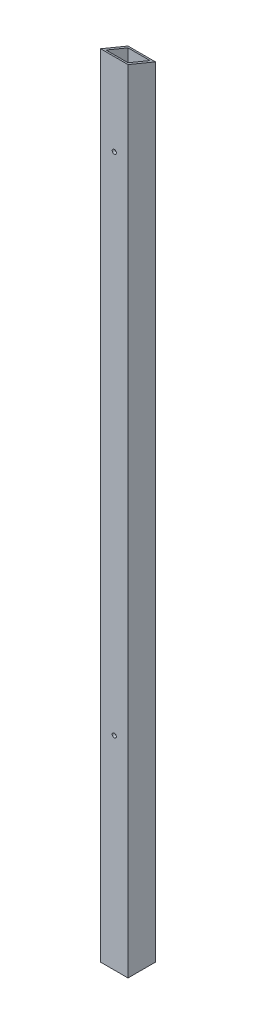
ISO-10303-21;
HEADER;
FILE_DESCRIPTION(('STEP AP214'),'2;1');
FILE_NAME('part.step','',(''),(''),'','','');
FILE_SCHEMA(('AUTOMOTIVE_DESIGN { 1 0 10303 214 1 1 1 1 }'));
ENDSEC;
DATA;
#1=APPLICATION_CONTEXT('core data for automotive mechanical design processes');
#2=APPLICATION_PROTOCOL_DEFINITION('international standard','automotive_design',2000,#1);
#3=PRODUCT_CONTEXT('',#1,'mechanical');
#4=PRODUCT('Part','Part','',(#3));
#5=PRODUCT_RELATED_PRODUCT_CATEGORY('part','',(#4));
#6=PRODUCT_DEFINITION_FORMATION('','',#4);
#7=PRODUCT_DEFINITION_CONTEXT('part definition',#1,'design');
#8=PRODUCT_DEFINITION('design','',#6,#7);
#9=PRODUCT_DEFINITION_SHAPE('','',#8);
#10=(LENGTH_UNIT() NAMED_UNIT(*) SI_UNIT(.MILLI.,.METRE.));
#11=(NAMED_UNIT(*) PLANE_ANGLE_UNIT() SI_UNIT($,.RADIAN.));
#12=(NAMED_UNIT(*) SI_UNIT($,.STERADIAN.) SOLID_ANGLE_UNIT());
#13=UNCERTAINTY_MEASURE_WITH_UNIT(LENGTH_MEASURE(1.E-05),#10,'distance_accuracy_value','');
#14=(GEOMETRIC_REPRESENTATION_CONTEXT(3) GLOBAL_UNCERTAINTY_ASSIGNED_CONTEXT((#13)) GLOBAL_UNIT_ASSIGNED_CONTEXT((#10,
#11,#12)) REPRESENTATION_CONTEXT('',''));
#15=CARTESIAN_POINT('',(0.,0.,0.));
#16=DIRECTION('',(0.,0.,1.));
#17=DIRECTION('',(1.,0.,0.));
#18=AXIS2_PLACEMENT_3D('',#15,#16,#17);
#19=CARTESIAN_POINT('',(15.875,819.15,0.));
#20=DIRECTION('',(0.,0.,1.));
#21=DIRECTION('',(1.,0.,0.));
#22=AXIS2_PLACEMENT_3D('',#19,#20,#21);
#23=CYLINDRICAL_SURFACE('',#22,2.413);
#24=CARTESIAN_POINT('',(15.875,819.15,-28.575));
#25=DIRECTION('',(0.,0.,1.));
#26=DIRECTION('',(1.,0.,0.));
#27=AXIS2_PLACEMENT_3D('',#24,#25,#26);
#28=CIRCLE('',#27,2.413);
#29=CARTESIAN_POINT('',(18.288,819.15,-28.575));
#30=VERTEX_POINT('',#29);
#31=EDGE_CURVE('E124',#30,#30,#28,.F.);
#32=ORIENTED_EDGE('',*,*,#31,.F.);
#33=EDGE_LOOP('',(#32));
#34=FACE_BOUND('',#33,.T.);
#35=CARTESIAN_POINT('',(15.875,819.15,-31.75));
#36=DIRECTION('',(0.,0.,1.));
#37=DIRECTION('',(1.,0.,0.));
#38=AXIS2_PLACEMENT_3D('',#35,#36,#37);
#39=CIRCLE('',#38,2.413);
#40=CARTESIAN_POINT('',(18.288,819.15,-31.75));
#41=VERTEX_POINT('',#40);
#42=EDGE_CURVE('E20',#41,#41,#39,.T.);
#43=ORIENTED_EDGE('',*,*,#42,.F.);
#44=EDGE_LOOP('',(#43));
#45=FACE_BOUND('',#44,.T.);
#46=ADVANCED_FACE('F17',(#34,#45),#23,.F.);
#47=CARTESIAN_POINT('',(15.875,234.8484,0.));
#48=DIRECTION('',(0.,0.,1.));
#49=DIRECTION('',(1.,0.,0.));
#50=AXIS2_PLACEMENT_3D('',#47,#48,#49);
#51=CYLINDRICAL_SURFACE('',#50,2.413);
#52=CARTESIAN_POINT('',(15.875,234.8484,-28.575));
#53=DIRECTION('',(0.,0.,1.));
#54=DIRECTION('',(1.,0.,0.));
#55=AXIS2_PLACEMENT_3D('',#52,#53,#54);
#56=CIRCLE('',#55,2.413);
#57=CARTESIAN_POINT('',(18.288,234.8484,-28.575));
#58=VERTEX_POINT('',#57);
#59=EDGE_CURVE('E123',#58,#58,#56,.F.);
#60=ORIENTED_EDGE('',*,*,#59,.F.);
#61=EDGE_LOOP('',(#60));
#62=FACE_BOUND('',#61,.T.);
#63=CARTESIAN_POINT('',(15.875,234.8484,-31.75));
#64=DIRECTION('',(0.,0.,1.));
#65=DIRECTION('',(1.,0.,0.));
#66=AXIS2_PLACEMENT_3D('',#63,#64,#65);
#67=CIRCLE('',#66,2.413);
#68=CARTESIAN_POINT('',(18.288,234.8484,-31.75));
#69=VERTEX_POINT('',#68);
#70=EDGE_CURVE('E125',#69,#69,#67,.T.);
#71=ORIENTED_EDGE('',*,*,#70,.F.);
#72=EDGE_LOOP('',(#71));
#73=FACE_BOUND('',#72,.T.);
#74=ADVANCED_FACE('F150',(#62,#73),#51,.F.);
#75=CARTESIAN_POINT('',(31.75,0.,-31.75));
#76=DIRECTION('',(0.,0.,-1.));
#77=DIRECTION('',(-1.,0.,0.));
#78=AXIS2_PLACEMENT_3D('',#75,#76,#77);
#79=PLANE('',#78);
#80=ORIENTED_EDGE('',*,*,#70,.T.);
#81=EDGE_LOOP('',(#80));
#82=FACE_BOUND('',#81,.T.);
#83=ORIENTED_EDGE('',*,*,#42,.T.);
#84=EDGE_LOOP('',(#83));
#85=FACE_BOUND('',#84,.T.);
#86=DIRECTION('',(0.,1.,0.));
#87=VECTOR('',#86,1.);
#88=CARTESIAN_POINT('',(0.,0.,-31.75));
#89=LINE('',#88,#87);
#90=CARTESIAN_POINT('',(0.,901.248719394582,-31.7500000000081));
#91=VERTEX_POINT('',#90);
#92=CARTESIAN_POINT('',(0.,0.,-31.75));
#93=VERTEX_POINT('',#92);
#94=EDGE_CURVE('E117',#91,#93,#89,.F.);
#95=ORIENTED_EDGE('',*,*,#94,.F.);
#96=DIRECTION('',(1.,0.,0.));
#97=VECTOR('',#96,1.);
#98=CARTESIAN_POINT('',(31.75,901.248719394641,-31.7500000000326));
#99=LINE('',#98,#97);
#100=CARTESIAN_POINT('',(31.75,901.248719394582,-31.7500000000081));
#101=VERTEX_POINT('',#100);
#102=EDGE_CURVE('E303',#91,#101,#99,.T.);
#103=ORIENTED_EDGE('',*,*,#102,.T.);
#104=DIRECTION('',(0.,1.,0.));
#105=VECTOR('',#104,1.);
#106=CARTESIAN_POINT('',(31.75,0.,-31.75));
#107=LINE('',#106,#105);
#108=CARTESIAN_POINT('',(31.75,0.,-31.75));
#109=VERTEX_POINT('',#108);
#110=EDGE_CURVE('E308',#109,#101,#107,.T.);
#111=ORIENTED_EDGE('',*,*,#110,.F.);
#112=DIRECTION('',(1.,0.,0.));
#113=VECTOR('',#112,1.);
#114=CARTESIAN_POINT('',(0.,0.,-31.75));
#115=LINE('',#114,#113);
#116=EDGE_CURVE('E114',#109,#93,#115,.F.);
#117=ORIENTED_EDGE('',*,*,#116,.T.);
#118=EDGE_LOOP('',(#95,#103,#111,#117));
#119=FACE_BOUND('',#118,.T.);
#120=ADVANCED_FACE('F146',(#82,#85,#119),#79,.T.);
#121=CARTESIAN_POINT('',(28.575,0.,-28.575));
#122=DIRECTION('',(-1.,0.,0.));
#123=DIRECTION('',(0.,0.,1.));
#124=AXIS2_PLACEMENT_3D('',#121,#122,#123);
#125=PLANE('',#124);
#126=DIRECTION('',(0.,1.,0.));
#127=VECTOR('',#126,1.);
#128=CARTESIAN_POINT('',(28.575,0.,-3.175));
#129=LINE('',#128,#127);
#130=CARTESIAN_POINT('',(28.575,913.084871939398,-3.17500000000756));
#131=VERTEX_POINT('',#130);
#132=CARTESIAN_POINT('',(28.575,0.,-3.175));
#133=VERTEX_POINT('',#132);
#134=EDGE_CURVE('E82',#131,#133,#129,.F.);
#135=ORIENTED_EDGE('',*,*,#134,.F.);
#136=DIRECTION('',(0.,-0.382683432365094,-0.923879532511285));
#137=VECTOR('',#136,1.);
#138=CARTESIAN_POINT('',(28.575,914.4,0.));
#139=LINE('',#138,#137);
#140=CARTESIAN_POINT('',(28.575,902.563847455183,-28.5750000000006));
#141=VERTEX_POINT('',#140);
#142=EDGE_CURVE('E295',#131,#141,#139,.T.);
#143=ORIENTED_EDGE('',*,*,#142,.T.);
#144=DIRECTION('',(0.,1.,0.));
#145=VECTOR('',#144,1.);
#146=CARTESIAN_POINT('',(28.575,0.,-28.575));
#147=LINE('',#146,#145);
#148=CARTESIAN_POINT('',(28.575,0.,-28.575));
#149=VERTEX_POINT('',#148);
#150=EDGE_CURVE('E85',#149,#141,#147,.T.);
#151=ORIENTED_EDGE('',*,*,#150,.F.);
#152=DIRECTION('',(0.,0.,1.));
#153=VECTOR('',#152,1.);
#154=CARTESIAN_POINT('',(28.575,0.,0.));
#155=LINE('',#154,#153);
#156=EDGE_CURVE('E79',#149,#133,#155,.T.);
#157=ORIENTED_EDGE('',*,*,#156,.T.);
#158=EDGE_LOOP('',(#135,#143,#151,#157));
#159=FACE_BOUND('',#158,.T.);
#160=ADVANCED_FACE('F81',(#159),#125,.T.);
#161=CARTESIAN_POINT('',(3.175,0.,-28.575));
#162=DIRECTION('',(0.,0.,1.));
#163=DIRECTION('',(1.,0.,0.));
#164=AXIS2_PLACEMENT_3D('',#161,#162,#163);
#165=PLANE('',#164);
#166=ORIENTED_EDGE('',*,*,#59,.T.);
#167=EDGE_LOOP('',(#166));
#168=FACE_BOUND('',#167,.T.);
#169=ORIENTED_EDGE('',*,*,#31,.T.);
#170=EDGE_LOOP('',(#169));
#171=FACE_BOUND('',#170,.T.);
#172=ORIENTED_EDGE('',*,*,#150,.T.);
#173=DIRECTION('',(1.,0.,0.));
#174=VECTOR('',#173,1.);
#175=CARTESIAN_POINT('',(31.75,902.563847455188,-28.5750000000024));
#176=LINE('',#175,#174);
#177=CARTESIAN_POINT('',(3.175,902.563847455183,-28.5750000000006));
#178=VERTEX_POINT('',#177);
#179=EDGE_CURVE('E292',#141,#178,#176,.F.);
#180=ORIENTED_EDGE('',*,*,#179,.T.);
#181=DIRECTION('',(0.,1.,0.));
#182=VECTOR('',#181,1.);
#183=CARTESIAN_POINT('',(3.175,0.,-28.575));
#184=LINE('',#183,#182);
#185=CARTESIAN_POINT('',(3.175,0.,-28.575));
#186=VERTEX_POINT('',#185);
#187=EDGE_CURVE('E102',#186,#178,#184,.T.);
#188=ORIENTED_EDGE('',*,*,#187,.F.);
#189=DIRECTION('',(1.,0.,0.));
#190=VECTOR('',#189,1.);
#191=CARTESIAN_POINT('',(0.,0.,-28.575));
#192=LINE('',#191,#190);
#193=EDGE_CURVE('E109',#186,#149,#192,.T.);
#194=ORIENTED_EDGE('',*,*,#193,.T.);
#195=EDGE_LOOP('',(#172,#180,#188,#194));
#196=FACE_BOUND('',#195,.T.);
#197=ADVANCED_FACE('F193',(#168,#171,#196),#165,.T.);
#198=CARTESIAN_POINT('',(3.175,0.,-3.175));
#199=DIRECTION('',(1.,0.,0.));
#200=DIRECTION('',(0.,0.,-1.));
#201=AXIS2_PLACEMENT_3D('',#198,#199,#200);
#202=PLANE('',#201);
#203=ORIENTED_EDGE('',*,*,#187,.T.);
#204=DIRECTION('',(0.,-0.382683432365094,-0.923879532511285));
#205=VECTOR('',#204,1.);
#206=CARTESIAN_POINT('',(3.175,914.4,0.));
#207=LINE('',#206,#205);
#208=CARTESIAN_POINT('',(3.175,913.084871939398,-3.17500000000756));
#209=VERTEX_POINT('',#208);
#210=EDGE_CURVE('E296',#178,#209,#207,.F.);
#211=ORIENTED_EDGE('',*,*,#210,.T.);
#212=DIRECTION('',(0.,1.,0.));
#213=VECTOR('',#212,1.);
#214=CARTESIAN_POINT('',(3.175,0.,-3.175));
#215=LINE('',#214,#213);
#216=CARTESIAN_POINT('',(3.175,0.,-3.175));
#217=VERTEX_POINT('',#216);
#218=EDGE_CURVE('E101',#217,#209,#215,.T.);
#219=ORIENTED_EDGE('',*,*,#218,.F.);
#220=DIRECTION('',(0.,0.,1.));
#221=VECTOR('',#220,1.);
#222=CARTESIAN_POINT('',(3.175,0.,0.));
#223=LINE('',#222,#221);
#224=EDGE_CURVE('E107',#217,#186,#223,.F.);
#225=ORIENTED_EDGE('',*,*,#224,.T.);
#226=EDGE_LOOP('',(#203,#211,#219,#225));
#227=FACE_BOUND('',#226,.T.);
#228=ADVANCED_FACE('F189',(#227),#202,.T.);
#229=CARTESIAN_POINT('',(28.575,0.,-3.175));
#230=DIRECTION('',(0.,0.,-1.));
#231=DIRECTION('',(-1.,0.,0.));
#232=AXIS2_PLACEMENT_3D('',#229,#230,#231);
#233=PLANE('',#232);
#234=CARTESIAN_POINT('',(15.875,234.8484,-3.175));
#235=DIRECTION('',(0.,0.,1.));
#236=DIRECTION('',(1.,0.,0.));
#237=AXIS2_PLACEMENT_3D('',#234,#235,#236);
#238=CIRCLE('',#237,2.413);
#239=CARTESIAN_POINT('',(18.288,234.8484,-3.175));
#240=VERTEX_POINT('',#239);
#241=EDGE_CURVE('E130',#240,#240,#238,.T.);
#242=ORIENTED_EDGE('',*,*,#241,.T.);
#243=EDGE_LOOP('',(#242));
#244=FACE_BOUND('',#243,.T.);
#245=CARTESIAN_POINT('',(15.875,819.15,-3.175));
#246=DIRECTION('',(0.,0.,1.));
#247=DIRECTION('',(1.,0.,0.));
#248=AXIS2_PLACEMENT_3D('',#245,#246,#247);
#249=CIRCLE('',#248,2.413);
#250=CARTESIAN_POINT('',(18.288,819.15,-3.175));
#251=VERTEX_POINT('',#250);
#252=EDGE_CURVE('E134',#251,#251,#249,.T.);
#253=ORIENTED_EDGE('',*,*,#252,.T.);
#254=EDGE_LOOP('',(#253));
#255=FACE_BOUND('',#254,.T.);
#256=ORIENTED_EDGE('',*,*,#218,.T.);
#257=DIRECTION('',(1.,0.,0.));
#258=VECTOR('',#257,1.);
#259=CARTESIAN_POINT('',(31.75,913.084871939453,-3.17500000003019));
#260=LINE('',#259,#258);
#261=EDGE_CURVE('E99',#209,#131,#260,.T.);
#262=ORIENTED_EDGE('',*,*,#261,.T.);
#263=ORIENTED_EDGE('',*,*,#134,.T.);
#264=DIRECTION('',(1.,0.,0.));
#265=VECTOR('',#264,1.);
#266=CARTESIAN_POINT('',(0.,0.,-3.175));
#267=LINE('',#266,#265);
#268=EDGE_CURVE('E90',#133,#217,#267,.F.);
#269=ORIENTED_EDGE('',*,*,#268,.T.);
#270=EDGE_LOOP('',(#256,#262,#263,#269));
#271=FACE_BOUND('',#270,.T.);
#272=ADVANCED_FACE('F96',(#244,#255,#271),#233,.T.);
#273=CARTESIAN_POINT('',(0.,0.,-31.75));
#274=DIRECTION('',(-1.,0.,0.));
#275=DIRECTION('',(0.,0.,1.));
#276=AXIS2_PLACEMENT_3D('',#273,#274,#275);
#277=PLANE('',#276);
#278=DIRECTION('',(0.,1.,0.));
#279=VECTOR('',#278,1.);
#280=CARTESIAN_POINT('',(0.,0.,0.));
#281=LINE('',#280,#279);
#282=CARTESIAN_POINT('',(0.,914.4,0.));
#283=VERTEX_POINT('',#282);
#284=CARTESIAN_POINT('',(0.,0.,0.));
#285=VERTEX_POINT('',#284);
#286=EDGE_CURVE('E133',#283,#285,#281,.F.);
#287=ORIENTED_EDGE('',*,*,#286,.F.);
#288=DIRECTION('',(0.,-0.382683432365094,-0.923879532511285));
#289=VECTOR('',#288,1.);
#290=CARTESIAN_POINT('',(0.,914.4,0.));
#291=LINE('',#290,#289);
#292=EDGE_CURVE('E305',#283,#91,#291,.T.);
#293=ORIENTED_EDGE('',*,*,#292,.T.);
#294=ORIENTED_EDGE('',*,*,#94,.T.);
#295=DIRECTION('',(0.,0.,1.));
#296=VECTOR('',#295,1.);
#297=CARTESIAN_POINT('',(0.,0.,0.));
#298=LINE('',#297,#296);
#299=EDGE_CURVE('E91',#93,#285,#298,.T.);
#300=ORIENTED_EDGE('',*,*,#299,.T.);
#301=EDGE_LOOP('',(#287,#293,#294,#300));
#302=FACE_BOUND('',#301,.T.);
#303=ADVANCED_FACE('F183',(#302),#277,.T.);
#304=CARTESIAN_POINT('',(0.,0.,0.));
#305=DIRECTION('',(0.,1.,0.));
#306=DIRECTION('',(0.,0.,1.));
#307=AXIS2_PLACEMENT_3D('',#304,#305,#306);
#308=PLANE('',#307);
#309=ORIENTED_EDGE('',*,*,#224,.F.);
#310=ORIENTED_EDGE('',*,*,#268,.F.);
#311=ORIENTED_EDGE('',*,*,#156,.F.);
#312=ORIENTED_EDGE('',*,*,#193,.F.);
#313=EDGE_LOOP('',(#309,#310,#311,#312));
#314=FACE_BOUND('',#313,.T.);
#315=ORIENTED_EDGE('',*,*,#116,.F.);
#316=DIRECTION('',(0.,0.,-1.));
#317=VECTOR('',#316,1.);
#318=CARTESIAN_POINT('',(31.75,0.,0.));
#319=LINE('',#318,#317);
#320=CARTESIAN_POINT('',(31.75,0.,0.));
#321=VERTEX_POINT('',#320);
#322=EDGE_CURVE('E310',#321,#109,#319,.T.);
#323=ORIENTED_EDGE('',*,*,#322,.F.);
#324=DIRECTION('',(1.,0.,0.));
#325=VECTOR('',#324,1.);
#326=CARTESIAN_POINT('',(0.,0.,0.));
#327=LINE('',#326,#325);
#328=EDGE_CURVE('E318',#285,#321,#327,.T.);
#329=ORIENTED_EDGE('',*,*,#328,.F.);
#330=ORIENTED_EDGE('',*,*,#299,.F.);
#331=EDGE_LOOP('',(#315,#323,#329,#330));
#332=FACE_BOUND('',#331,.T.);
#333=ADVANCED_FACE('F104',(#314,#332),#308,.F.);
#334=CARTESIAN_POINT('',(31.75,0.,0.));
#335=DIRECTION('',(1.,0.,0.));
#336=DIRECTION('',(0.,0.,-1.));
#337=AXIS2_PLACEMENT_3D('',#334,#335,#336);
#338=PLANE('',#337);
#339=ORIENTED_EDGE('',*,*,#110,.T.);
#340=DIRECTION('',(0.,-0.382683432365094,-0.923879532511285));
#341=VECTOR('',#340,1.);
#342=CARTESIAN_POINT('',(31.75,914.4,0.));
#343=LINE('',#342,#341);
#344=CARTESIAN_POINT('',(31.75,914.4,0.));
#345=VERTEX_POINT('',#344);
#346=EDGE_CURVE('E35',#101,#345,#343,.F.);
#347=ORIENTED_EDGE('',*,*,#346,.T.);
#348=DIRECTION('',(0.,1.,0.));
#349=VECTOR('',#348,1.);
#350=CARTESIAN_POINT('',(31.75,0.,0.));
#351=LINE('',#350,#349);
#352=EDGE_CURVE('E314',#321,#345,#351,.T.);
#353=ORIENTED_EDGE('',*,*,#352,.F.);
#354=ORIENTED_EDGE('',*,*,#322,.T.);
#355=EDGE_LOOP('',(#339,#347,#353,#354));
#356=FACE_BOUND('',#355,.T.);
#357=ADVANCED_FACE('F177',(#356),#338,.T.);
#358=CARTESIAN_POINT('',(31.75,914.4,0.));
#359=DIRECTION('',(0.,-0.923879532511285,0.382683432365094));
#360=DIRECTION('',(0.,-0.382683432365094,-0.923879532511285));
#361=AXIS2_PLACEMENT_3D('',#358,#359,#360);
#362=PLANE('',#361);
#363=ORIENTED_EDGE('',*,*,#210,.F.);
#364=ORIENTED_EDGE('',*,*,#179,.F.);
#365=ORIENTED_EDGE('',*,*,#142,.F.);
#366=ORIENTED_EDGE('',*,*,#261,.F.);
#367=EDGE_LOOP('',(#363,#364,#365,#366));
#368=FACE_BOUND('',#367,.T.);
#369=ORIENTED_EDGE('',*,*,#346,.F.);
#370=ORIENTED_EDGE('',*,*,#102,.F.);
#371=ORIENTED_EDGE('',*,*,#292,.F.);
#372=DIRECTION('',(1.,0.,0.));
#373=VECTOR('',#372,1.);
#374=CARTESIAN_POINT('',(0.,914.4,0.));
#375=LINE('',#374,#373);
#376=EDGE_CURVE('E129',#345,#283,#375,.F.);
#377=ORIENTED_EDGE('',*,*,#376,.F.);
#378=EDGE_LOOP('',(#369,#370,#371,#377));
#379=FACE_BOUND('',#378,.T.);
#380=ADVANCED_FACE('F173',(#368,#379),#362,.F.);
#381=CARTESIAN_POINT('',(15.875,819.15,0.));
#382=DIRECTION('',(0.,0.,1.));
#383=DIRECTION('',(1.,0.,0.));
#384=AXIS2_PLACEMENT_3D('',#381,#382,#383);
#385=CYLINDRICAL_SURFACE('',#384,2.413);
#386=ORIENTED_EDGE('',*,*,#252,.F.);
#387=EDGE_LOOP('',(#386));
#388=FACE_BOUND('',#387,.T.);
#389=CARTESIAN_POINT('',(15.875,819.15,0.));
#390=DIRECTION('',(0.,0.,1.));
#391=DIRECTION('',(1.,0.,0.));
#392=AXIS2_PLACEMENT_3D('',#389,#390,#391);
#393=CIRCLE('',#392,2.413);
#394=CARTESIAN_POINT('',(18.288,819.15,0.));
#395=VERTEX_POINT('',#394);
#396=EDGE_CURVE('E26',#395,#395,#393,.F.);
#397=ORIENTED_EDGE('',*,*,#396,.F.);
#398=EDGE_LOOP('',(#397));
#399=FACE_BOUND('',#398,.T.);
#400=ADVANCED_FACE('F166',(#388,#399),#385,.F.);
#401=CARTESIAN_POINT('',(15.875,234.8484,0.));
#402=DIRECTION('',(0.,0.,1.));
#403=DIRECTION('',(1.,0.,0.));
#404=AXIS2_PLACEMENT_3D('',#401,#402,#403);
#405=CYLINDRICAL_SURFACE('',#404,2.413);
#406=ORIENTED_EDGE('',*,*,#241,.F.);
#407=EDGE_LOOP('',(#406));
#408=FACE_BOUND('',#407,.T.);
#409=CARTESIAN_POINT('',(15.875,234.8484,0.));
#410=DIRECTION('',(0.,0.,1.));
#411=DIRECTION('',(1.,0.,0.));
#412=AXIS2_PLACEMENT_3D('',#409,#410,#411);
#413=CIRCLE('',#412,2.413);
#414=CARTESIAN_POINT('',(18.288,234.8484,0.));
#415=VERTEX_POINT('',#414);
#416=EDGE_CURVE('E11',#415,#415,#413,.F.);
#417=ORIENTED_EDGE('',*,*,#416,.F.);
#418=EDGE_LOOP('',(#417));
#419=FACE_BOUND('',#418,.T.);
#420=ADVANCED_FACE('F160',(#408,#419),#405,.F.);
#421=CARTESIAN_POINT('',(0.,0.,0.));
#422=DIRECTION('',(0.,0.,1.));
#423=DIRECTION('',(1.,0.,0.));
#424=AXIS2_PLACEMENT_3D('',#421,#422,#423);
#425=PLANE('',#424);
#426=ORIENTED_EDGE('',*,*,#416,.T.);
#427=EDGE_LOOP('',(#426));
#428=FACE_BOUND('',#427,.T.);
#429=ORIENTED_EDGE('',*,*,#396,.T.);
#430=EDGE_LOOP('',(#429));
#431=FACE_BOUND('',#430,.T.);
#432=ORIENTED_EDGE('',*,*,#352,.T.);
#433=ORIENTED_EDGE('',*,*,#376,.T.);
#434=ORIENTED_EDGE('',*,*,#286,.T.);
#435=ORIENTED_EDGE('',*,*,#328,.T.);
#436=EDGE_LOOP('',(#432,#433,#434,#435));
#437=FACE_BOUND('',#436,.T.);
#438=ADVANCED_FACE('F158',(#428,#431,#437),#425,.T.);
#439=CLOSED_SHELL('',(#46,#74,#120,#160,#197,#228,#272,#303,#333,#357,#380,#400,#420,#438));
#440=MANIFOLD_SOLID_BREP('B1',#439);
#441=ADVANCED_BREP_SHAPE_REPRESENTATION('',(#18,#440),#14);
#442=SHAPE_DEFINITION_REPRESENTATION(#9,#441);
ENDSEC;
END-ISO-10303-21;
